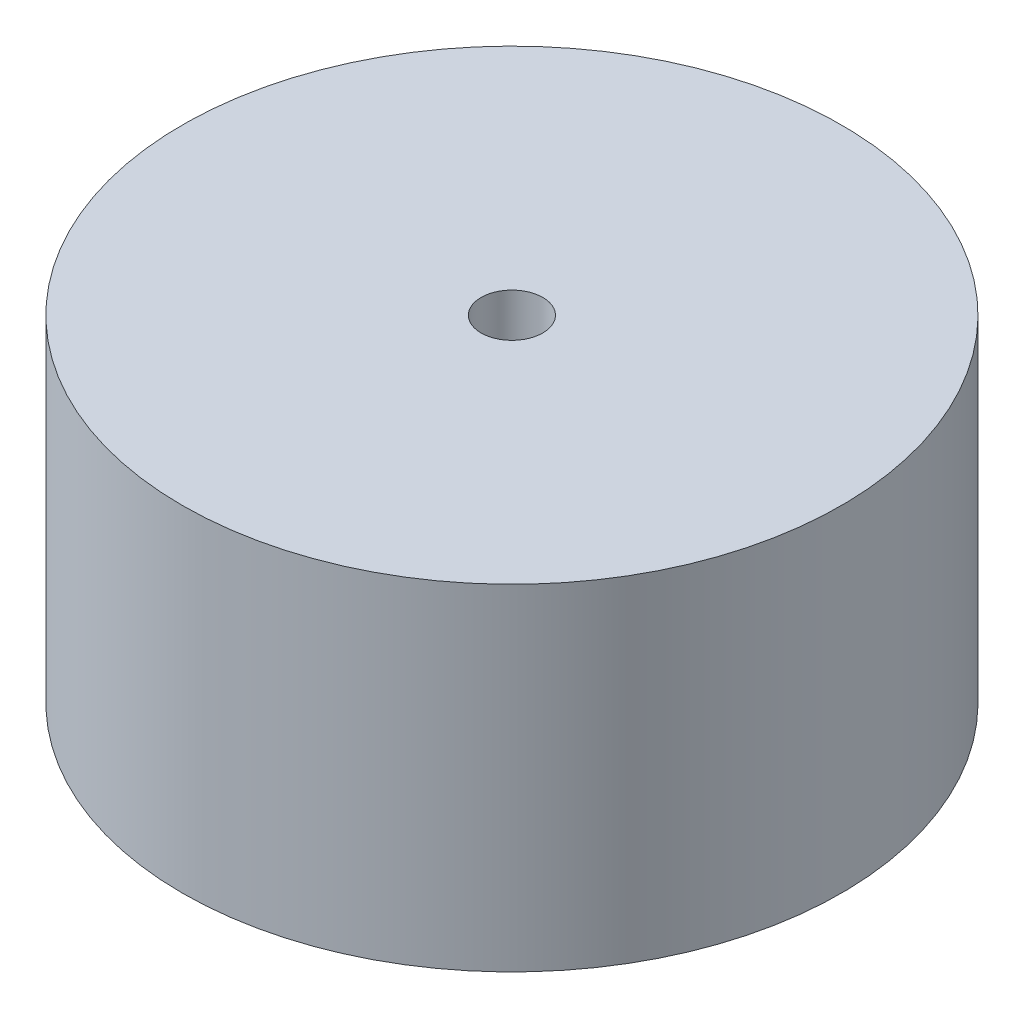
ISO-10303-21;
HEADER;
FILE_DESCRIPTION(('STEP AP214'),'2;1');
FILE_NAME('part.step','',(''),(''),'','','');
FILE_SCHEMA(('AUTOMOTIVE_DESIGN { 1 0 10303 214 1 1 1 1 }'));
ENDSEC;
DATA;
#1=APPLICATION_CONTEXT('core data for automotive mechanical design processes');
#2=APPLICATION_PROTOCOL_DEFINITION('international standard','automotive_design',2000,#1);
#3=PRODUCT_CONTEXT('',#1,'mechanical');
#4=PRODUCT('Part','Part','',(#3));
#5=PRODUCT_RELATED_PRODUCT_CATEGORY('part','',(#4));
#6=PRODUCT_DEFINITION_FORMATION('','',#4);
#7=PRODUCT_DEFINITION_CONTEXT('part definition',#1,'design');
#8=PRODUCT_DEFINITION('design','',#6,#7);
#9=PRODUCT_DEFINITION_SHAPE('','',#8);
#10=(LENGTH_UNIT() NAMED_UNIT(*) SI_UNIT(.MILLI.,.METRE.));
#11=(NAMED_UNIT(*) PLANE_ANGLE_UNIT() SI_UNIT($,.RADIAN.));
#12=(NAMED_UNIT(*) SI_UNIT($,.STERADIAN.) SOLID_ANGLE_UNIT());
#13=UNCERTAINTY_MEASURE_WITH_UNIT(LENGTH_MEASURE(1.E-05),#10,'distance_accuracy_value','');
#14=(GEOMETRIC_REPRESENTATION_CONTEXT(3) GLOBAL_UNCERTAINTY_ASSIGNED_CONTEXT((#13)) GLOBAL_UNIT_ASSIGNED_CONTEXT((#10,
#11,#12)) REPRESENTATION_CONTEXT('',''));
#15=CARTESIAN_POINT('',(0.,0.,0.));
#16=DIRECTION('',(0.,0.,1.));
#17=DIRECTION('',(1.,0.,0.));
#18=AXIS2_PLACEMENT_3D('',#15,#16,#17);
#19=CARTESIAN_POINT('',(0.,17.7,0.));
#20=DIRECTION('',(0.,-1.,0.));
#21=DIRECTION('',(0.,0.,-1.));
#22=AXIS2_PLACEMENT_3D('',#19,#20,#21);
#23=CYLINDRICAL_SURFACE('',#22,17.375);
#24=CARTESIAN_POINT('',(0.,17.7,0.));
#25=DIRECTION('',(0.,1.,0.));
#26=DIRECTION('',(0.,0.,1.));
#27=AXIS2_PLACEMENT_3D('',#24,#25,#26);
#28=CIRCLE('',#27,17.375);
#29=CARTESIAN_POINT('',(0.,17.7,17.375));
#30=VERTEX_POINT('',#29);
#31=EDGE_CURVE('E10',#30,#30,#28,.T.);
#32=ORIENTED_EDGE('',*,*,#31,.F.);
#33=EDGE_LOOP('',(#32));
#34=FACE_BOUND('',#33,.T.);
#35=CARTESIAN_POINT('',(0.,0.,0.));
#36=DIRECTION('',(0.,1.,0.));
#37=DIRECTION('',(0.,0.,1.));
#38=AXIS2_PLACEMENT_3D('',#35,#36,#37);
#39=CIRCLE('',#38,17.375);
#40=CARTESIAN_POINT('',(0.,0.,17.375));
#41=VERTEX_POINT('',#40);
#42=EDGE_CURVE('E42',#41,#41,#39,.T.);
#43=ORIENTED_EDGE('',*,*,#42,.T.);
#44=EDGE_LOOP('',(#43));
#45=FACE_BOUND('',#44,.T.);
#46=ADVANCED_FACE('F39',(#34,#45),#23,.T.);
#47=CARTESIAN_POINT('',(0.,17.7,0.));
#48=DIRECTION('',(0.,1.,0.));
#49=DIRECTION('',(0.,0.,1.));
#50=AXIS2_PLACEMENT_3D('',#47,#48,#49);
#51=PLANE('',#50);
#52=CARTESIAN_POINT('',(0.,17.7,0.));
#53=DIRECTION('',(0.,1.,0.));
#54=DIRECTION('',(0.,0.,1.));
#55=AXIS2_PLACEMENT_3D('',#52,#53,#54);
#56=CIRCLE('',#55,1.625);
#57=CARTESIAN_POINT('',(0.,17.7,1.625));
#58=VERTEX_POINT('',#57);
#59=EDGE_CURVE('E60',#58,#58,#56,.F.);
#60=ORIENTED_EDGE('',*,*,#59,.T.);
#61=EDGE_LOOP('',(#60));
#62=FACE_BOUND('',#61,.T.);
#63=ORIENTED_EDGE('',*,*,#31,.T.);
#64=EDGE_LOOP('',(#63));
#65=FACE_BOUND('',#64,.T.);
#66=ADVANCED_FACE('F99',(#62,#65),#51,.T.);
#67=CARTESIAN_POINT('',(0.,0.,0.));
#68=DIRECTION('',(0.,1.,0.));
#69=DIRECTION('',(0.,0.,1.));
#70=AXIS2_PLACEMENT_3D('',#67,#68,#69);
#71=PLANE('',#70);
#72=CARTESIAN_POINT('',(0.,0.,0.));
#73=DIRECTION('',(0.,-1.,0.));
#74=DIRECTION('',(0.,0.,-1.));
#75=AXIS2_PLACEMENT_3D('',#72,#73,#74);
#76=CIRCLE('',#75,13.545);
#77=CARTESIAN_POINT('',(0.,0.,-13.545));
#78=VERTEX_POINT('',#77);
#79=EDGE_CURVE('E51',#78,#78,#76,.T.);
#80=ORIENTED_EDGE('',*,*,#79,.F.);
#81=EDGE_LOOP('',(#80));
#82=FACE_BOUND('',#81,.T.);
#83=ORIENTED_EDGE('',*,*,#42,.F.);
#84=EDGE_LOOP('',(#83));
#85=FACE_BOUND('',#84,.T.);
#86=ADVANCED_FACE('F93',(#82,#85),#71,.F.);
#87=CARTESIAN_POINT('',(0.,8.,0.));
#88=DIRECTION('',(0.,-1.,0.));
#89=DIRECTION('',(0.,0.,-1.));
#90=AXIS2_PLACEMENT_3D('',#87,#88,#89);
#91=CYLINDRICAL_SURFACE('',#90,13.545);
#92=CARTESIAN_POINT('',(0.,8.,0.));
#93=DIRECTION('',(0.,-1.,0.));
#94=DIRECTION('',(0.,0.,-1.));
#95=AXIS2_PLACEMENT_3D('',#92,#93,#94);
#96=CIRCLE('',#95,13.545);
#97=CARTESIAN_POINT('',(0.,8.,-13.545));
#98=VERTEX_POINT('',#97);
#99=EDGE_CURVE('E49',#98,#98,#96,.T.);
#100=ORIENTED_EDGE('',*,*,#99,.F.);
#101=EDGE_LOOP('',(#100));
#102=FACE_BOUND('',#101,.T.);
#103=ORIENTED_EDGE('',*,*,#79,.T.);
#104=EDGE_LOOP('',(#103));
#105=FACE_BOUND('',#104,.T.);
#106=ADVANCED_FACE('F87',(#102,#105),#91,.F.);
#107=CARTESIAN_POINT('',(0.,8.,0.));
#108=DIRECTION('',(0.,-1.,0.));
#109=DIRECTION('',(0.,0.,-1.));
#110=AXIS2_PLACEMENT_3D('',#107,#108,#109);
#111=PLANE('',#110);
#112=CARTESIAN_POINT('',(0.,8.,0.));
#113=DIRECTION('',(0.,-1.,0.));
#114=DIRECTION('',(0.,0.,-1.));
#115=AXIS2_PLACEMENT_3D('',#112,#113,#114);
#116=CIRCLE('',#115,3.48500000000002);
#117=CARTESIAN_POINT('',(0.,8.,-3.48500000000002));
#118=VERTEX_POINT('',#117);
#119=EDGE_CURVE('E57',#118,#118,#116,.T.);
#120=ORIENTED_EDGE('',*,*,#119,.F.);
#121=EDGE_LOOP('',(#120));
#122=FACE_BOUND('',#121,.T.);
#123=ORIENTED_EDGE('',*,*,#99,.T.);
#124=EDGE_LOOP('',(#123));
#125=FACE_BOUND('',#124,.T.);
#126=ADVANCED_FACE('F81',(#122,#125),#111,.T.);
#127=CARTESIAN_POINT('',(0.,4.,0.));
#128=DIRECTION('',(0.,1.,0.));
#129=DIRECTION('',(0.,0.,1.));
#130=AXIS2_PLACEMENT_3D('',#127,#128,#129);
#131=CYLINDRICAL_SURFACE('',#130,3.48500000000002);
#132=CARTESIAN_POINT('',(0.,4.,0.));
#133=DIRECTION('',(0.,-1.,0.));
#134=DIRECTION('',(0.,0.,-1.));
#135=AXIS2_PLACEMENT_3D('',#132,#133,#134);
#136=CIRCLE('',#135,3.48500000000002);
#137=CARTESIAN_POINT('',(0.,4.,-3.48500000000002));
#138=VERTEX_POINT('',#137);
#139=EDGE_CURVE('E54',#138,#138,#136,.T.);
#140=ORIENTED_EDGE('',*,*,#139,.F.);
#141=EDGE_LOOP('',(#140));
#142=FACE_BOUND('',#141,.T.);
#143=ORIENTED_EDGE('',*,*,#119,.T.);
#144=EDGE_LOOP('',(#143));
#145=FACE_BOUND('',#144,.T.);
#146=ADVANCED_FACE('F75',(#142,#145),#131,.T.);
#147=CARTESIAN_POINT('',(0.,4.,0.));
#148=DIRECTION('',(0.,-1.,0.));
#149=DIRECTION('',(0.,0.,-1.));
#150=AXIS2_PLACEMENT_3D('',#147,#148,#149);
#151=PLANE('',#150);
#152=CARTESIAN_POINT('',(0.,4.,0.));
#153=DIRECTION('',(0.,-1.,0.));
#154=DIRECTION('',(0.,0.,-1.));
#155=AXIS2_PLACEMENT_3D('',#152,#153,#154);
#156=CIRCLE('',#155,1.625);
#157=CARTESIAN_POINT('',(0.,4.,-1.625));
#158=VERTEX_POINT('',#157);
#159=EDGE_CURVE('E65',#158,#158,#156,.T.);
#160=ORIENTED_EDGE('',*,*,#159,.F.);
#161=EDGE_LOOP('',(#160));
#162=FACE_BOUND('',#161,.T.);
#163=ORIENTED_EDGE('',*,*,#139,.T.);
#164=EDGE_LOOP('',(#163));
#165=FACE_BOUND('',#164,.T.);
#166=ADVANCED_FACE('F72',(#162,#165),#151,.T.);
#167=CARTESIAN_POINT('',(0.,22.2961940777126,0.));
#168=DIRECTION('',(0.,-1.,0.));
#169=DIRECTION('',(0.,0.,-1.));
#170=AXIS2_PLACEMENT_3D('',#167,#168,#169);
#171=CYLINDRICAL_SURFACE('',#170,1.625);
#172=ORIENTED_EDGE('',*,*,#159,.T.);
#173=EDGE_LOOP('',(#172));
#174=FACE_BOUND('',#173,.T.);
#175=ORIENTED_EDGE('',*,*,#59,.F.);
#176=EDGE_LOOP('',(#175));
#177=FACE_BOUND('',#176,.T.);
#178=ADVANCED_FACE('F69',(#174,#177),#171,.F.);
#179=CLOSED_SHELL('',(#46,#66,#86,#106,#126,#146,#166,#178));
#180=MANIFOLD_SOLID_BREP('B2',#179);
#181=ADVANCED_BREP_SHAPE_REPRESENTATION('',(#18,#180),#14);
#182=SHAPE_DEFINITION_REPRESENTATION(#9,#181);
ENDSEC;
END-ISO-10303-21;
